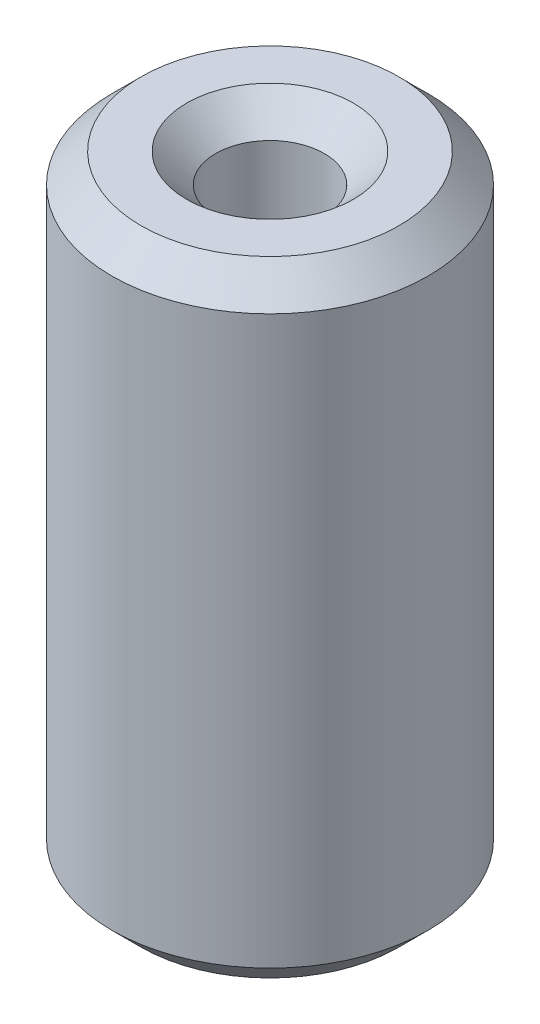
ISO-10303-21;
HEADER;
FILE_DESCRIPTION(('STEP AP214'),'2;1');
FILE_NAME('part.step','',(''),(''),'','','');
FILE_SCHEMA(('AUTOMOTIVE_DESIGN { 1 0 10303 214 1 1 1 1 }'));
ENDSEC;
DATA;
#1=APPLICATION_CONTEXT('core data for automotive mechanical design processes');
#2=APPLICATION_PROTOCOL_DEFINITION('international standard','automotive_design',2000,#1);
#3=PRODUCT_CONTEXT('',#1,'mechanical');
#4=PRODUCT('Part','Part','',(#3));
#5=PRODUCT_RELATED_PRODUCT_CATEGORY('part','',(#4));
#6=PRODUCT_DEFINITION_FORMATION('','',#4);
#7=PRODUCT_DEFINITION_CONTEXT('part definition',#1,'design');
#8=PRODUCT_DEFINITION('design','',#6,#7);
#9=PRODUCT_DEFINITION_SHAPE('','',#8);
#10=(LENGTH_UNIT() NAMED_UNIT(*) SI_UNIT(.MILLI.,.METRE.));
#11=(NAMED_UNIT(*) PLANE_ANGLE_UNIT() SI_UNIT($,.RADIAN.));
#12=(NAMED_UNIT(*) SI_UNIT($,.STERADIAN.) SOLID_ANGLE_UNIT());
#13=UNCERTAINTY_MEASURE_WITH_UNIT(LENGTH_MEASURE(1.E-05),#10,'distance_accuracy_value','');
#14=(GEOMETRIC_REPRESENTATION_CONTEXT(3) GLOBAL_UNCERTAINTY_ASSIGNED_CONTEXT((#13)) GLOBAL_UNIT_ASSIGNED_CONTEXT((#10,
#11,#12)) REPRESENTATION_CONTEXT('',''));
#15=CARTESIAN_POINT('',(0.,0.,0.));
#16=DIRECTION('',(0.,0.,1.));
#17=DIRECTION('',(1.,0.,0.));
#18=AXIS2_PLACEMENT_3D('',#15,#16,#17);
#19=CARTESIAN_POINT('',(0.,29.6454880723914,0.));
#20=DIRECTION('',(0.,-1.,0.));
#21=DIRECTION('',(0.,0.,-1.));
#22=AXIS2_PLACEMENT_3D('',#19,#20,#21);
#23=CYLINDRICAL_SURFACE('',#22,7.5);
#24=CARTESIAN_POINT('',(0.,1.38037466091383,0.));
#25=DIRECTION('',(0.,1.,0.));
#26=DIRECTION('',(0.,0.,1.));
#27=AXIS2_PLACEMENT_3D('',#24,#25,#26);
#28=CIRCLE('',#27,7.5);
#29=CARTESIAN_POINT('',(0.,1.38037466091383,7.5));
#30=VERTEX_POINT('',#29);
#31=EDGE_CURVE('E10',#30,#30,#28,.T.);
#32=ORIENTED_EDGE('',*,*,#31,.T.);
#33=EDGE_LOOP('',(#32));
#34=FACE_BOUND('',#33,.T.);
#35=CARTESIAN_POINT('',(0.,28.2651134114775,0.));
#36=DIRECTION('',(0.,1.,0.));
#37=DIRECTION('',(0.,0.,1.));
#38=AXIS2_PLACEMENT_3D('',#35,#36,#37);
#39=CIRCLE('',#38,7.5);
#40=CARTESIAN_POINT('',(0.,28.2651134114775,7.5));
#41=VERTEX_POINT('',#40);
#42=EDGE_CURVE('E50',#41,#41,#39,.F.);
#43=ORIENTED_EDGE('',*,*,#42,.T.);
#44=EDGE_LOOP('',(#43));
#45=FACE_BOUND('',#44,.T.);
#46=ADVANCED_FACE('F39',(#34,#45),#23,.T.);
#47=CARTESIAN_POINT('',(0.,29.6454880723914,0.));
#48=DIRECTION('',(0.,1.,0.));
#49=DIRECTION('',(0.,0.,1.));
#50=AXIS2_PLACEMENT_3D('',#47,#48,#49);
#51=PLANE('',#50);
#52=CARTESIAN_POINT('',(0.,29.6454880723914,0.));
#53=DIRECTION('',(0.,1.,0.));
#54=DIRECTION('',(0.,0.,1.));
#55=AXIS2_PLACEMENT_3D('',#52,#53,#54);
#56=CIRCLE('',#55,3.95757607633343);
#57=CARTESIAN_POINT('',(0.,29.6454880723914,3.95757607633343));
#58=VERTEX_POINT('',#57);
#59=EDGE_CURVE('E58',#58,#58,#56,.F.);
#60=ORIENTED_EDGE('',*,*,#59,.T.);
#61=EDGE_LOOP('',(#60));
#62=FACE_BOUND('',#61,.T.);
#63=CARTESIAN_POINT('',(0.,29.6454880723914,0.));
#64=DIRECTION('',(0.,1.,0.));
#65=DIRECTION('',(0.,0.,1.));
#66=AXIS2_PLACEMENT_3D('',#63,#64,#65);
#67=CIRCLE('',#66,6.11962533908616);
#68=CARTESIAN_POINT('',(0.,29.6454880723914,6.11962533908616));
#69=VERTEX_POINT('',#68);
#70=EDGE_CURVE('E61',#69,#69,#67,.T.);
#71=ORIENTED_EDGE('',*,*,#70,.T.);
#72=EDGE_LOOP('',(#71));
#73=FACE_BOUND('',#72,.T.);
#74=ADVANCED_FACE('F88',(#62,#73),#51,.T.);
#75=CARTESIAN_POINT('',(0.,0.,0.));
#76=DIRECTION('',(0.,1.,0.));
#77=DIRECTION('',(0.,0.,1.));
#78=AXIS2_PLACEMENT_3D('',#75,#76,#77);
#79=PLANE('',#78);
#80=CARTESIAN_POINT('',(0.,0.,0.));
#81=DIRECTION('',(0.,1.,0.));
#82=DIRECTION('',(0.,0.,1.));
#83=AXIS2_PLACEMENT_3D('',#80,#81,#82);
#84=CIRCLE('',#83,3.95757607633342);
#85=CARTESIAN_POINT('',(0.,0.,3.95757607633342));
#86=VERTEX_POINT('',#85);
#87=EDGE_CURVE('E51',#86,#86,#84,.T.);
#88=ORIENTED_EDGE('',*,*,#87,.T.);
#89=EDGE_LOOP('',(#88));
#90=FACE_BOUND('',#89,.T.);
#91=CARTESIAN_POINT('',(0.,0.,0.));
#92=DIRECTION('',(0.,1.,0.));
#93=DIRECTION('',(0.,0.,1.));
#94=AXIS2_PLACEMENT_3D('',#91,#92,#93);
#95=CIRCLE('',#94,6.11962533908617);
#96=CARTESIAN_POINT('',(0.,0.,6.11962533908617));
#97=VERTEX_POINT('',#96);
#98=EDGE_CURVE('E54',#97,#97,#95,.F.);
#99=ORIENTED_EDGE('',*,*,#98,.T.);
#100=EDGE_LOOP('',(#99));
#101=FACE_BOUND('',#100,.T.);
#102=ADVANCED_FACE('F83',(#90,#101),#79,.F.);
#103=CARTESIAN_POINT('',(0.,29.6454880723914,0.));
#104=DIRECTION('',(0.,-1.,0.));
#105=DIRECTION('',(0.,0.,-1.));
#106=AXIS2_PLACEMENT_3D('',#103,#104,#105);
#107=CYLINDRICAL_SURFACE('',#106,2.57720141541959);
#108=CARTESIAN_POINT('',(0.,28.2651134114775,0.));
#109=DIRECTION('',(0.,1.,0.));
#110=DIRECTION('',(0.,0.,1.));
#111=AXIS2_PLACEMENT_3D('',#108,#109,#110);
#112=CIRCLE('',#111,2.57720141541959);
#113=CARTESIAN_POINT('',(0.,28.2651134114775,2.57720141541959));
#114=VERTEX_POINT('',#113);
#115=EDGE_CURVE('E67',#114,#114,#112,.T.);
#116=ORIENTED_EDGE('',*,*,#115,.T.);
#117=EDGE_LOOP('',(#116));
#118=FACE_BOUND('',#117,.T.);
#119=CARTESIAN_POINT('',(0.,1.38037466091384,0.));
#120=DIRECTION('',(0.,1.,0.));
#121=DIRECTION('',(0.,0.,1.));
#122=AXIS2_PLACEMENT_3D('',#119,#120,#121);
#123=CIRCLE('',#122,2.57720141541959);
#124=CARTESIAN_POINT('',(0.,1.38037466091384,2.57720141541959));
#125=VERTEX_POINT('',#124);
#126=EDGE_CURVE('E69',#125,#125,#123,.F.);
#127=ORIENTED_EDGE('',*,*,#126,.T.);
#128=EDGE_LOOP('',(#127));
#129=FACE_BOUND('',#128,.T.);
#130=ADVANCED_FACE('F71',(#118,#129),#107,.F.);
#131=CARTESIAN_POINT('',(0.,28.2651134114775,0.));
#132=DIRECTION('',(0.,1.,0.));
#133=DIRECTION('',(0.,0.,1.));
#134=AXIS2_PLACEMENT_3D('',#131,#132,#133);
#135=CONICAL_SURFACE('',#134,2.57720141541959,0.785398163397449);
#136=ORIENTED_EDGE('',*,*,#59,.F.);
#137=EDGE_LOOP('',(#136));
#138=FACE_BOUND('',#137,.T.);
#139=ORIENTED_EDGE('',*,*,#115,.F.);
#140=EDGE_LOOP('',(#139));
#141=FACE_BOUND('',#140,.T.);
#142=ADVANCED_FACE('F77',(#138,#141),#135,.F.);
#143=CARTESIAN_POINT('',(0.,0.,0.));
#144=DIRECTION('',(0.,-1.,0.));
#145=DIRECTION('',(0.,0.,-1.));
#146=AXIS2_PLACEMENT_3D('',#143,#144,#145);
#147=CONICAL_SURFACE('',#146,3.95757607633342,0.785398163397444);
#148=ORIENTED_EDGE('',*,*,#126,.F.);
#149=EDGE_LOOP('',(#148));
#150=FACE_BOUND('',#149,.T.);
#151=ORIENTED_EDGE('',*,*,#87,.F.);
#152=EDGE_LOOP('',(#151));
#153=FACE_BOUND('',#152,.T.);
#154=ADVANCED_FACE('F73',(#150,#153),#147,.F.);
#155=CARTESIAN_POINT('',(0.,1.38037466091383,0.));
#156=DIRECTION('',(0.,1.,0.));
#157=DIRECTION('',(0.,0.,1.));
#158=AXIS2_PLACEMENT_3D('',#155,#156,#157);
#159=CONICAL_SURFACE('',#158,7.5,0.785398163397451);
#160=ORIENTED_EDGE('',*,*,#98,.F.);
#161=EDGE_LOOP('',(#160));
#162=FACE_BOUND('',#161,.T.);
#163=ORIENTED_EDGE('',*,*,#31,.F.);
#164=EDGE_LOOP('',(#163));
#165=FACE_BOUND('',#164,.T.);
#166=ADVANCED_FACE('F76',(#162,#165),#159,.T.);
#167=CARTESIAN_POINT('',(0.,29.6454880723914,0.));
#168=DIRECTION('',(0.,-1.,0.));
#169=DIRECTION('',(0.,0.,-1.));
#170=AXIS2_PLACEMENT_3D('',#167,#168,#169);
#171=CONICAL_SURFACE('',#170,6.11962533908616,0.785398163397446);
#172=ORIENTED_EDGE('',*,*,#42,.F.);
#173=EDGE_LOOP('',(#172));
#174=FACE_BOUND('',#173,.T.);
#175=ORIENTED_EDGE('',*,*,#70,.F.);
#176=EDGE_LOOP('',(#175));
#177=FACE_BOUND('',#176,.T.);
#178=ADVANCED_FACE('F45',(#174,#177),#171,.T.);
#179=CLOSED_SHELL('',(#46,#74,#102,#130,#142,#154,#166,#178));
#180=MANIFOLD_SOLID_BREP('B2',#179);
#181=ADVANCED_BREP_SHAPE_REPRESENTATION('',(#18,#180),#14);
#182=SHAPE_DEFINITION_REPRESENTATION(#9,#181);
ENDSEC;
END-ISO-10303-21;
